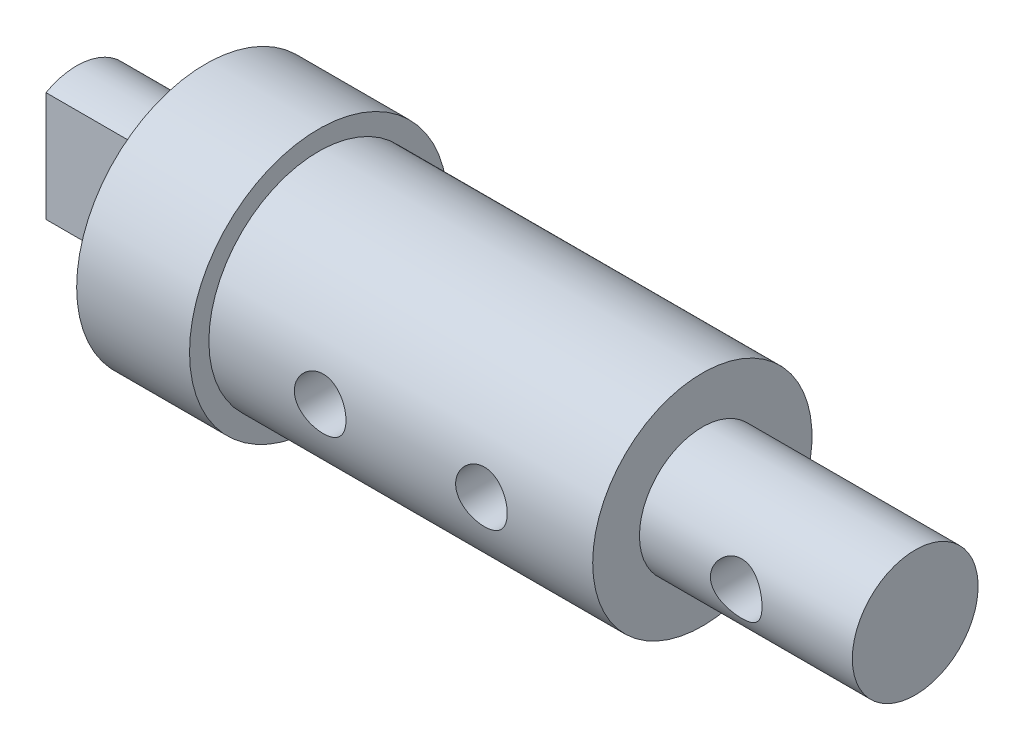
ISO-10303-21;
HEADER;
FILE_DESCRIPTION(('STEP AP214'),'2;1');
FILE_NAME('part.step','',(''),(''),'','','');
FILE_SCHEMA(('AUTOMOTIVE_DESIGN { 1 0 10303 214 1 1 1 1 }'));
ENDSEC;
DATA;
#1=APPLICATION_CONTEXT('core data for automotive mechanical design processes');
#2=APPLICATION_PROTOCOL_DEFINITION('international standard','automotive_design',2000,#1);
#3=PRODUCT_CONTEXT('',#1,'mechanical');
#4=PRODUCT('Part','Part','',(#3));
#5=PRODUCT_RELATED_PRODUCT_CATEGORY('part','',(#4));
#6=PRODUCT_DEFINITION_FORMATION('','',#4);
#7=PRODUCT_DEFINITION_CONTEXT('part definition',#1,'design');
#8=PRODUCT_DEFINITION('design','',#6,#7);
#9=PRODUCT_DEFINITION_SHAPE('','',#8);
#10=(LENGTH_UNIT() NAMED_UNIT(*) SI_UNIT(.MILLI.,.METRE.));
#11=(NAMED_UNIT(*) PLANE_ANGLE_UNIT() SI_UNIT($,.RADIAN.));
#12=(NAMED_UNIT(*) SI_UNIT($,.STERADIAN.) SOLID_ANGLE_UNIT());
#13=UNCERTAINTY_MEASURE_WITH_UNIT(LENGTH_MEASURE(1.E-05),#10,'distance_accuracy_value','');
#14=(GEOMETRIC_REPRESENTATION_CONTEXT(3) GLOBAL_UNCERTAINTY_ASSIGNED_CONTEXT((#13)) GLOBAL_UNIT_ASSIGNED_CONTEXT((#10,
#11,#12)) REPRESENTATION_CONTEXT('',''));
#15=CARTESIAN_POINT('',(0.,0.,0.));
#16=DIRECTION('',(0.,0.,1.));
#17=DIRECTION('',(1.,0.,0.));
#18=AXIS2_PLACEMENT_3D('',#15,#16,#17);
#19=CARTESIAN_POINT('',(-11.,4.,0.));
#20=DIRECTION('',(1.,0.,0.));
#21=DIRECTION('',(0.,0.,-1.));
#22=AXIS2_PLACEMENT_3D('',#19,#20,#21);
#23=PLANE('',#22);
#24=CARTESIAN_POINT('',(-11.,0.,0.));
#25=DIRECTION('',(-1.,0.,0.));
#26=DIRECTION('',(0.,0.,1.));
#27=AXIS2_PLACEMENT_3D('',#24,#25,#26);
#28=CIRCLE('',#27,4.);
#29=CARTESIAN_POINT('',(-11.,0.,4.));
#30=VERTEX_POINT('',#29);
#31=EDGE_CURVE('E103',#30,#30,#28,.T.);
#32=ORIENTED_EDGE('',*,*,#31,.T.);
#33=EDGE_LOOP('',(#32));
#34=FACE_BOUND('',#33,.T.);
#35=CARTESIAN_POINT('',(-11.,0.,0.));
#36=DIRECTION('',(-1.,0.,0.));
#37=DIRECTION('',(0.,0.,1.));
#38=AXIS2_PLACEMENT_3D('',#35,#36,#37);
#39=CIRCLE('',#38,1.95);
#40=CARTESIAN_POINT('',(-11.,1.70293863659264,0.95));
#41=VERTEX_POINT('',#40);
#42=CARTESIAN_POINT('',(-11.,-1.70293863659264,0.95));
#43=VERTEX_POINT('',#42);
#44=EDGE_CURVE('E71',#41,#43,#39,.T.);
#45=ORIENTED_EDGE('',*,*,#44,.F.);
#46=DIRECTION('',(0.,1.,0.));
#47=VECTOR('',#46,1.);
#48=CARTESIAN_POINT('',(-11.,1.70293863659264,0.95));
#49=LINE('',#48,#47);
#50=EDGE_CURVE('E56',#43,#41,#49,.T.);
#51=ORIENTED_EDGE('',*,*,#50,.F.);
#52=EDGE_LOOP('',(#45,#51));
#53=FACE_BOUND('',#52,.T.);
#54=ADVANCED_FACE('F38',(#34,#53),#23,.F.);
#55=CARTESIAN_POINT('',(11.,0.,0.));
#56=DIRECTION('',(-1.,0.,0.));
#57=DIRECTION('',(0.,0.,1.));
#58=AXIS2_PLACEMENT_3D('',#55,#56,#57);
#59=PLANE('',#58);
#60=CARTESIAN_POINT('',(11.,0.,0.));
#61=DIRECTION('',(-1.,0.,0.));
#62=DIRECTION('',(0.,0.,1.));
#63=AXIS2_PLACEMENT_3D('',#60,#61,#62);
#64=CIRCLE('',#63,1.95);
#65=CARTESIAN_POINT('',(11.,0.,1.95));
#66=VERTEX_POINT('',#65);
#67=EDGE_CURVE('E119',#66,#66,#64,.T.);
#68=ORIENTED_EDGE('',*,*,#67,.F.);
#69=EDGE_LOOP('',(#68));
#70=FACE_BOUND('',#69,.T.);
#71=ADVANCED_FACE('F40',(#70),#59,.F.);
#72=CARTESIAN_POINT('',(0.,0.,0.));
#73=DIRECTION('',(-1.,0.,0.));
#74=DIRECTION('',(0.,0.,1.));
#75=AXIS2_PLACEMENT_3D('',#72,#73,#74);
#76=CYLINDRICAL_SURFACE('',#75,1.95);
#77=CARTESIAN_POINT('',(8.2,0.,1.95));
#78=CARTESIAN_POINT('',(8.19999561484422,-0.0429090313419901,1.94999672341557));
#79=CARTESIAN_POINT('',(8.19652724311315,-0.085888342064864,1.94856720628234));
#80=CARTESIAN_POINT('',(8.1827756589033,-0.170631413111786,1.94298745323884));
#81=CARTESIAN_POINT('',(8.17247436845365,-0.212391641271655,1.9388300002972));
#82=CARTESIAN_POINT('',(8.14549892205006,-0.293332706793942,1.92824161861606));
#83=CARTESIAN_POINT('',(8.12884607825116,-0.332521661978991,1.92181829817982));
#84=CARTESIAN_POINT('',(8.08972686451433,-0.407512664985541,1.90732640965225));
#85=CARTESIAN_POINT('',(8.06726235491835,-0.443315791627978,1.89925836821886));
#86=CARTESIAN_POINT('',(8.01599422376931,-0.512328535941208,1.88184548957991));
#87=CARTESIAN_POINT('',(7.98695194370779,-0.545350436491069,1.87245967638695));
#88=CARTESIAN_POINT('',(7.92385691540709,-0.606215314900565,1.85365040280598));
#89=CARTESIAN_POINT('',(7.88980161873364,-0.634055642241007,1.84422692565549));
#90=CARTESIAN_POINT('',(7.81569076461274,-0.685068224505028,1.82591120842074));
#91=CARTESIAN_POINT('',(7.77542742340432,-0.707956963973854,1.81706526245235));
#92=CARTESIAN_POINT('',(7.69120598907634,-0.746553227100349,1.80155327251159));
#93=CARTESIAN_POINT('',(7.64724975476787,-0.762264338268037,1.79488614000379));
#94=CARTESIAN_POINT('',(7.55904984114932,-0.785290354739013,1.7849287525371));
#95=CARTESIAN_POINT('',(7.51491719883067,-0.792965844819978,1.78149424615378));
#96=CARTESIAN_POINT('',(7.42586702385375,-0.800828309110054,1.77797484246209));
#97=CARTESIAN_POINT('',(7.38094991792058,-0.801019235111354,1.77788817751959));
#98=CARTESIAN_POINT('',(7.29514725765571,-0.794179388349747,1.78095178580417));
#99=CARTESIAN_POINT('',(7.25420903844626,-0.78768115995166,1.78386336584154));
#100=CARTESIAN_POINT('',(7.17406547075399,-0.768538670196156,1.79219309966416));
#101=CARTESIAN_POINT('',(7.13486044386342,-0.755893273415524,1.797611716507));
#102=CARTESIAN_POINT('',(7.05832270958237,-0.72457087237544,1.81046615939341));
#103=CARTESIAN_POINT('',(7.02104646164019,-0.70577301351224,1.81794188156145));
#104=CARTESIAN_POINT('',(6.95003550703099,-0.662764489967313,1.83405826915435));
#105=CARTESIAN_POINT('',(6.91630217963794,-0.638551728635918,1.8426993853038));
#106=CARTESIAN_POINT('',(6.85043438462089,-0.583077511996559,1.86103210997552));
#107=CARTESIAN_POINT('',(6.81865565660725,-0.551401819169442,1.87075186794315));
#108=CARTESIAN_POINT('',(6.76074406394002,-0.483071456427335,1.88954932234969));
#109=CARTESIAN_POINT('',(6.7346124428595,-0.446415692718701,1.89862687707092));
#110=CARTESIAN_POINT('',(6.68823676076048,-0.368112749409276,1.91536631307924));
#111=CARTESIAN_POINT('',(6.66813316136798,-0.32637432507312,1.92299309754079));
#112=CARTESIAN_POINT('',(6.63535674002119,-0.239715356645508,1.93570389467281));
#113=CARTESIAN_POINT('',(6.62267994047933,-0.194796530364717,1.94078926823741));
#114=CARTESIAN_POINT('',(6.60585174810321,-0.106028246740718,1.947592446582));
#115=CARTESIAN_POINT('',(6.60122268997408,-0.0622837505311799,1.94949863424514));
#116=CARTESIAN_POINT('',(6.5992026175439,0.025394675090731,1.95032689994955));
#117=CARTESIAN_POINT('',(6.60180960500578,0.0693285488609997,1.94924980182663));
#118=CARTESIAN_POINT('',(6.61384196911744,0.153929784121658,1.94435517646388));
#119=CARTESIAN_POINT('',(6.62293556721853,0.194652915831953,1.94067106370678));
#120=CARTESIAN_POINT('',(6.6472252838577,0.273953719435646,1.93107373958897));
#121=CARTESIAN_POINT('',(6.66242217884788,0.31253111764092,1.92516024461553));
#122=CARTESIAN_POINT('',(6.69898395450667,0.387789767584396,1.9114466003203));
#123=CARTESIAN_POINT('',(6.72052498685184,0.42437553612789,1.90359377896847));
#124=CARTESIAN_POINT('',(6.76896933529564,0.493543234552231,1.88684486743537));
#125=CARTESIAN_POINT('',(6.79587485816018,0.526123507764669,1.87794834853499));
#126=CARTESIAN_POINT('',(6.85646997843418,0.588728992058345,1.85931117667256));
#127=CARTESIAN_POINT('',(6.89050069678151,0.618420212052976,1.84955477593176));
#128=CARTESIAN_POINT('',(6.96322412391789,0.671759343328893,1.83085779829248));
#129=CARTESIAN_POINT('',(7.00191777164973,0.695406034461956,1.82191738634325));
#130=CARTESIAN_POINT('',(7.08358096875058,0.736197343418284,1.80582459713075));
#131=CARTESIAN_POINT('',(7.1265976095117,0.753257657404576,1.79869577814369));
#132=CARTESIAN_POINT('',(7.21527611792536,0.779752559186946,1.78737165979351));
#133=CARTESIAN_POINT('',(7.26093586339064,0.789193176374287,1.78317404135551));
#134=CARTESIAN_POINT('',(7.34991089995457,0.799590354967792,1.77853442087226));
#135=CARTESIAN_POINT('',(7.39314487307093,0.801130612505573,1.77783414009031));
#136=CARTESIAN_POINT('',(7.47922743732201,0.797231752199945,1.77958595754649));
#137=CARTESIAN_POINT('',(7.522076082545,0.79179362980756,1.7820376061687));
#138=CARTESIAN_POINT('',(7.60424385693111,0.774577543050906,1.78958412283097));
#139=CARTESIAN_POINT('',(7.64363538545191,0.763087417138324,1.7945586316436));
#140=CARTESIAN_POINT('',(7.71994330442088,0.734370115122792,1.80649967652534));
#141=CARTESIAN_POINT('',(7.75685900038749,0.717141337322524,1.81346676866137));
#142=CARTESIAN_POINT('',(7.82954532447116,0.676262404791812,1.82911849623992));
#143=CARTESIAN_POINT('',(7.86511955409439,0.652293094373791,1.83788026892508));
#144=CARTESIAN_POINT('',(7.9319238109756,0.599067976193341,1.85591120740309));
#145=CARTESIAN_POINT('',(7.96315240099233,0.569810426761995,1.8651805396563));
#146=CARTESIAN_POINT('',(8.02261565280102,0.504416211253221,1.88395831298191));
#147=CARTESIAN_POINT('',(8.05049002288026,0.467942243301299,1.89343840250229));
#148=CARTESIAN_POINT('',(8.09973660829594,0.390479589657616,1.91091593888135));
#149=CARTESIAN_POINT('',(8.12110584241506,0.349488845672379,1.91891270529891));
#150=CARTESIAN_POINT('',(8.15625657521897,0.264840783941895,1.93239871367988));
#151=CARTESIAN_POINT('',(8.17016377058915,0.221242358589278,1.93792921101508));
#152=CARTESIAN_POINT('',(8.19032546727703,0.132131952930182,1.94602839446739));
#153=CARTESIAN_POINT('',(8.19660405760962,0.0866264679456242,1.94860640223781));
#154=CARTESIAN_POINT('',(8.19965144107654,0.027324271815631,1.94985742350373));
#155=CARTESIAN_POINT('',(8.20000139658767,0.0136657001260131,1.95000104352904));
#156=CARTESIAN_POINT('',(8.2,0.,1.95));
#157=B_SPLINE_CURVE_WITH_KNOTS('',3,(#77,#78,#79,#80,#81,#82,#83,#84,#85,#86,#87,#88,#89,#90,
#91,#92,#93,#94,#95,#96,#97,#98,#99,#100,#101,#102,#103,#104,#105,#106,#107,#108,#109,#110,#111,
#112,#113,#114,#115,#116,#117,#118,#119,#120,#121,#122,#123,#124,#125,#126,#127,#128,#129,#130,
#131,#132,#133,#134,#135,#136,#137,#138,#139,#140,#141,#142,#143,#144,#145,#146,#147,#148,#149,
#150,#151,#152,#153,#154,#155,#156),.UNSPECIFIED.,.T.,.F.,(4,2,2,2,2,2,2,2,2,2,2,2,2,2,2,2,2,2,
2,2,2,2,2,2,2,2,2,2,2,2,2,2,2,2,2,2,2,2,2,4),(0.,0.12868910604015,0.257720052398303,
0.386321800791211,0.514882433978023,0.649195259547643,0.783576602170147,0.924322071105401,
1.06499711570778,1.19904683011433,1.33302576635029,1.45710545627069,1.58120807325486,
1.70791159927516,1.83466427008986,1.97177168074285,2.10890925369481,2.24903045333578,
2.38907653919041,2.52048365488044,2.6518544860504,2.77694759457687,2.90205662230101,
3.03103321944288,3.16006298297189,3.29804287985753,3.43605060740075,3.57577045259725,
3.71537963016197,3.8445083327689,3.97361861748907,4.09707916302988,4.22057419617525,
4.35136297502192,4.48219490759108,4.62214410942357,4.76215735189233,4.89973150301332,
5.03687009464332,5.07785509657946),.UNSPECIFIED.);
#158=CARTESIAN_POINT('',(8.2,0.,1.95));
#159=VERTEX_POINT('',#158);
#160=EDGE_CURVE('E42',#159,#159,#157,.T.);
#161=ORIENTED_EDGE('',*,*,#160,.T.);
#162=EDGE_LOOP('',(#161));
#163=FACE_BOUND('',#162,.T.);
#164=CARTESIAN_POINT('',(4.4,0.,0.));
#165=DIRECTION('',(-1.,0.,0.));
#166=DIRECTION('',(0.,0.,1.));
#167=AXIS2_PLACEMENT_3D('',#164,#165,#166);
#168=CIRCLE('',#167,1.95);
#169=CARTESIAN_POINT('',(4.4,0.,1.95));
#170=VERTEX_POINT('',#169);
#171=EDGE_CURVE('E116',#170,#170,#168,.T.);
#172=ORIENTED_EDGE('',*,*,#171,.F.);
#173=EDGE_LOOP('',(#172));
#174=FACE_BOUND('',#173,.T.);
#175=ORIENTED_EDGE('',*,*,#67,.T.);
#176=EDGE_LOOP('',(#175));
#177=FACE_BOUND('',#176,.T.);
#178=ADVANCED_FACE('F168',(#163,#174,#177),#76,.T.);
#179=CARTESIAN_POINT('',(4.4,1.95,0.));
#180=DIRECTION('',(-1.,0.,0.));
#181=DIRECTION('',(0.,0.,1.));
#182=AXIS2_PLACEMENT_3D('',#179,#180,#181);
#183=PLANE('',#182);
#184=CARTESIAN_POINT('',(4.4,0.,0.));
#185=DIRECTION('',(-1.,0.,0.));
#186=DIRECTION('',(0.,0.,1.));
#187=AXIS2_PLACEMENT_3D('',#184,#185,#186);
#188=CIRCLE('',#187,3.4);
#189=CARTESIAN_POINT('',(4.4,0.,3.4));
#190=VERTEX_POINT('',#189);
#191=EDGE_CURVE('E113',#190,#190,#188,.T.);
#192=ORIENTED_EDGE('',*,*,#191,.F.);
#193=EDGE_LOOP('',(#192));
#194=FACE_BOUND('',#193,.T.);
#195=ORIENTED_EDGE('',*,*,#171,.T.);
#196=EDGE_LOOP('',(#195));
#197=FACE_BOUND('',#196,.T.);
#198=ADVANCED_FACE('F157',(#194,#197),#183,.F.);
#199=CARTESIAN_POINT('',(0.,0.,0.));
#200=DIRECTION('',(-1.,0.,0.));
#201=DIRECTION('',(0.,0.,1.));
#202=AXIS2_PLACEMENT_3D('',#199,#200,#201);
#203=CYLINDRICAL_SURFACE('',#202,3.4);
#204=CARTESIAN_POINT('',(-3.25000000000001,0.,3.4));
#205=CARTESIAN_POINT('',(-3.25000138257624,-0.0442828890104494,3.39999920700193));
#206=CARTESIAN_POINT('',(-3.25368922104659,-0.0885818084291685,3.39912616024286));
#207=CARTESIAN_POINT('',(-3.26832435041599,-0.175915514940349,3.39572786107722));
#208=CARTESIAN_POINT('',(-3.27927627604453,-0.218949476629174,3.39320155384915));
#209=CARTESIAN_POINT('',(-3.30807295814917,-0.302479006926497,3.38677723200764));
#210=CARTESIAN_POINT('',(-3.32590995546436,-0.342977373538071,3.38288076194345));
#211=CARTESIAN_POINT('',(-3.36794442721601,-0.420406214773078,3.37413377831048));
#212=CARTESIAN_POINT('',(-3.39214193510014,-0.45733667063274,3.36928325972473));
#213=CARTESIAN_POINT('',(-3.44668124609245,-0.527261498610895,3.35905731087336));
#214=CARTESIAN_POINT('',(-3.47711786750283,-0.560180846727603,3.35367453839874));
#215=CARTESIAN_POINT('',(-3.54306814651544,-0.620497668251346,3.34304094348988));
#216=CARTESIAN_POINT('',(-3.57858231552232,-0.647894584774907,3.33779013440955));
#217=CARTESIAN_POINT('',(-3.65424858455981,-0.69673104212994,3.3279417895732));
#218=CARTESIAN_POINT('',(-3.69445490660497,-0.718088631208784,3.32335361904944));
#219=CARTESIAN_POINT('',(-3.77801217586982,-0.753713813969134,3.3154563319138));
#220=CARTESIAN_POINT('',(-3.82136268180773,-0.76798240038408,3.31214703622461));
#221=CARTESIAN_POINT('',(-3.90915804781412,-0.788772472038238,3.30725733754028));
#222=CARTESIAN_POINT('',(-3.95356949759591,-0.79542787094868,3.30564708945677));
#223=CARTESIAN_POINT('',(-4.04290551852117,-0.801219421936976,3.3042483281059));
#224=CARTESIAN_POINT('',(-4.08783001530427,-0.800356650215363,3.30445955410068));
#225=CARTESIAN_POINT('',(-4.17590573272851,-0.791243640668968,3.30665295276135));
#226=CARTESIAN_POINT('',(-4.21907434515511,-0.783150998476764,3.3085973441129));
#227=CARTESIAN_POINT('',(-4.30342340451584,-0.760058530904059,3.31397801235517));
#228=CARTESIAN_POINT('',(-4.34460372414559,-0.745058263895399,3.31741438463254));
#229=CARTESIAN_POINT('',(-4.42423972600033,-0.708437040815857,3.32542773258422));
#230=CARTESIAN_POINT('',(-4.46266729571102,-0.686757246492453,3.33001477467667));
#231=CARTESIAN_POINT('',(-4.53539646765892,-0.637433629899277,3.33980670142656));
#232=CARTESIAN_POINT('',(-4.56969742336945,-0.609788874974957,3.34501168264489));
#233=CARTESIAN_POINT('',(-4.63410491629845,-0.548495026538218,3.35561357855381));
#234=CARTESIAN_POINT('',(-4.6640842982305,-0.514712433585336,3.36101202846297));
#235=CARTESIAN_POINT('',(-4.71797472638752,-0.442536048991823,3.37127401291468));
#236=CARTESIAN_POINT('',(-4.74188562650652,-0.404142146361179,3.3761375345766));
#237=CARTESIAN_POINT('',(-4.78299952809346,-0.323664358942364,3.38480157856909));
#238=CARTESIAN_POINT('',(-4.80018382131188,-0.281570576015671,3.38859912801242));
#239=CARTESIAN_POINT('',(-4.8271984549588,-0.194983075119437,3.39468153983429));
#240=CARTESIAN_POINT('',(-4.83703003729851,-0.150489763804476,3.39696665766292));
#241=CARTESIAN_POINT('',(-4.84887048102671,-0.061455065428755,3.39972963105663));
#242=CARTESIAN_POINT('',(-4.8510527545065,-0.0169379503659723,3.40024754238881));
#243=CARTESIAN_POINT('',(-4.84800553527808,0.071824979053773,3.39953094033689));
#244=CARTESIAN_POINT('',(-4.84277662908591,0.116070814601321,3.39829656562758));
#245=CARTESIAN_POINT('',(-4.82519888530828,0.202446218909627,3.3942395713106));
#246=CARTESIAN_POINT('',(-4.81294288220855,0.244595740300946,3.39143767165295));
#247=CARTESIAN_POINT('',(-4.78176342607093,0.326239658114239,3.38456018464209));
#248=CARTESIAN_POINT('',(-4.76283934740314,0.365733804982417,3.38048447777842));
#249=CARTESIAN_POINT('',(-4.71851266362885,0.441649076939153,3.37141401862615));
#250=CARTESIAN_POINT('',(-4.69301061967595,0.478010459574205,3.3664055208171));
#251=CARTESIAN_POINT('',(-4.63638084678495,0.545999609890309,3.35604963921623));
#252=CARTESIAN_POINT('',(-4.60525226397797,0.577626657767403,3.35070220406827));
#253=CARTESIAN_POINT('',(-4.537452093631,0.635950086248905,3.34012972984141));
#254=CARTESIAN_POINT('',(-4.50067551399393,0.662525528481494,3.3349098114692));
#255=CARTESIAN_POINT('',(-4.42308059491178,0.709125255454785,3.32531346767939));
#256=CARTESIAN_POINT('',(-4.38226243620765,0.729149832980448,3.32093700456791));
#257=CARTESIAN_POINT('',(-4.29796594709772,0.761935376062775,3.31356862031388));
#258=CARTESIAN_POINT('',(-4.25450491897498,0.774738916381593,3.3105686037199));
#259=CARTESIAN_POINT('',(-4.16596718678061,0.792838076864988,3.30628127954266));
#260=CARTESIAN_POINT('',(-4.12089079048705,0.798135119535665,3.30499364745974));
#261=CARTESIAN_POINT('',(-4.03162681292975,0.801003146635239,3.30429956964793));
#262=CARTESIAN_POINT('',(-3.98744567569744,0.798766627413206,3.30484625240445));
#263=CARTESIAN_POINT('',(-3.90010918556686,0.787066611938105,3.30765198526178));
#264=CARTESIAN_POINT('',(-3.85695381642731,0.777603230188658,3.30991100823198));
#265=CARTESIAN_POINT('',(-3.77307579097342,0.751817531882083,3.31586231665974));
#266=CARTESIAN_POINT('',(-3.73234272982121,0.73552740242264,3.31954787008928));
#267=CARTESIAN_POINT('',(-3.65416071465468,0.696576876392527,3.32793867266915));
#268=CARTESIAN_POINT('',(-3.61671216355573,0.673915699706666,3.3326440466772));
#269=CARTESIAN_POINT('',(-3.54522277656047,0.622245929440386,3.34268106211181));
#270=CARTESIAN_POINT('',(-3.51128143846707,0.593101982352834,3.34802472269653));
#271=CARTESIAN_POINT('',(-3.44870825839007,0.529562931526203,3.35866026246648));
#272=CARTESIAN_POINT('',(-3.42007765966705,0.495166601615449,3.36395212925266));
#273=CARTESIAN_POINT('',(-3.36850842708034,0.421454383265142,3.37398570433263));
#274=CARTESIAN_POINT('',(-3.34566514199259,0.382070362079803,3.37871758722063));
#275=CARTESIAN_POINT('',(-3.30695966133519,0.299915740605452,3.38699708058372));
#276=CARTESIAN_POINT('',(-3.29109204293149,0.257147801580798,3.39054561046907));
#277=CARTESIAN_POINT('',(-3.26937585077079,0.178662632892243,3.39548062309097));
#278=CARTESIAN_POINT('',(-3.2621246931537,0.143345464630853,3.39716431439956));
#279=CARTESIAN_POINT('',(-3.25243634711825,0.0720223718642146,3.39942429276551));
#280=CARTESIAN_POINT('',(-3.24999887551285,0.0360164880016412,3.40000064496708));
#281=CARTESIAN_POINT('',(-3.25000000000001,0.,3.4));
#282=B_SPLINE_CURVE_WITH_KNOTS('',3,(#204,#205,#206,#207,#208,#209,#210,#211,#212,#213,#214,
#215,#216,#217,#218,#219,#220,#221,#222,#223,#224,#225,#226,#227,#228,#229,#230,#231,#232,#233,
#234,#235,#236,#237,#238,#239,#240,#241,#242,#243,#244,#245,#246,#247,#248,#249,#250,#251,#252,
#253,#254,#255,#256,#257,#258,#259,#260,#261,#262,#263,#264,#265,#266,#267,#268,#269,#270,#271,
#272,#273,#274,#275,#276,#277,#278,#279,#280,#281),.UNSPECIFIED.,.T.,.F.,(4,2,2,2,2,2,2,2,2,2,2,
2,2,2,2,2,2,2,2,2,2,2,2,2,2,2,2,2,2,2,2,2,2,2,2,2,2,2,4),(0.,0.132716755427583,
0.265518270125257,0.398170558489669,0.530823544439286,0.665665930059246,0.800521906426332,
0.937128498860594,1.07371595571388,1.2078620387184,1.34198891948327,1.47326158640889,
1.60454264721202,1.73701489454393,1.8695078696723,2.00533236125466,2.1411601226639,
2.27736301305952,2.41354289287804,2.54661482614613,2.679676228774,2.81101898923861,
2.94237407617554,3.07584487259291,3.20933594122299,3.34570363234417,3.48206522780202,
3.61761420637393,3.75313749453009,3.88522445370752,4.01730932012046,4.14877831060256,
4.28026340607571,4.41480617201549,4.54938039519267,4.6860455254347,4.82260422448084,
4.93055275191511,5.03849492859528),.UNSPECIFIED.);
#283=CARTESIAN_POINT('',(-3.25000000000001,0.,3.4));
#284=VERTEX_POINT('',#283);
#285=EDGE_CURVE('E11',#284,#284,#282,.T.);
#286=ORIENTED_EDGE('',*,*,#285,.T.);
#287=EDGE_LOOP('',(#286));
#288=FACE_BOUND('',#287,.T.);
#289=CARTESIAN_POINT('',(-3.25000000000001,0.,-3.4));
#290=CARTESIAN_POINT('',(-3.25000138257624,0.0442828890104494,-3.39999920700193));
#291=CARTESIAN_POINT('',(-3.25368922104659,0.0885818084291685,-3.39912616024286));
#292=CARTESIAN_POINT('',(-3.26832435041599,0.175915514940349,-3.39572786107722));
#293=CARTESIAN_POINT('',(-3.27927627604453,0.218949476629174,-3.39320155384915));
#294=CARTESIAN_POINT('',(-3.30807295814917,0.302479006926497,-3.38677723200764));
#295=CARTESIAN_POINT('',(-3.32590995546436,0.342977373538071,-3.38288076194345));
#296=CARTESIAN_POINT('',(-3.36794442721601,0.420406214773078,-3.37413377831048));
#297=CARTESIAN_POINT('',(-3.39214193510014,0.45733667063274,-3.36928325972473));
#298=CARTESIAN_POINT('',(-3.44668124609245,0.527261498610895,-3.35905731087336));
#299=CARTESIAN_POINT('',(-3.47711786750283,0.560180846727603,-3.35367453839874));
#300=CARTESIAN_POINT('',(-3.54306814651544,0.620497668251346,-3.34304094348988));
#301=CARTESIAN_POINT('',(-3.57858231552232,0.647894584774908,-3.33779013440955));
#302=CARTESIAN_POINT('',(-3.65424858455981,0.69673104212994,-3.3279417895732));
#303=CARTESIAN_POINT('',(-3.69445490660497,0.718088631208784,-3.32335361904944));
#304=CARTESIAN_POINT('',(-3.77801217586982,0.753713813969134,-3.3154563319138));
#305=CARTESIAN_POINT('',(-3.82136268180773,0.76798240038408,-3.31214703622461));
#306=CARTESIAN_POINT('',(-3.90915804781412,0.788772472038238,-3.30725733754028));
#307=CARTESIAN_POINT('',(-3.95356949759591,0.79542787094868,-3.30564708945677));
#308=CARTESIAN_POINT('',(-4.04290551852117,0.801219421936976,-3.3042483281059));
#309=CARTESIAN_POINT('',(-4.08783001530427,0.800356650215363,-3.30445955410068));
#310=CARTESIAN_POINT('',(-4.17590573272851,0.791243640668968,-3.30665295276135));
#311=CARTESIAN_POINT('',(-4.21907434515511,0.783150998476764,-3.3085973441129));
#312=CARTESIAN_POINT('',(-4.30342340451584,0.760058530904059,-3.31397801235517));
#313=CARTESIAN_POINT('',(-4.34460372414559,0.745058263895399,-3.31741438463254));
#314=CARTESIAN_POINT('',(-4.42423972600033,0.708437040815857,-3.32542773258422));
#315=CARTESIAN_POINT('',(-4.46266729571102,0.686757246492453,-3.33001477467667));
#316=CARTESIAN_POINT('',(-4.53539646765892,0.637433629899277,-3.33980670142656));
#317=CARTESIAN_POINT('',(-4.56969742336945,0.609788874974957,-3.34501168264489));
#318=CARTESIAN_POINT('',(-4.63410491629845,0.548495026538218,-3.35561357855381));
#319=CARTESIAN_POINT('',(-4.6640842982305,0.514712433585336,-3.36101202846297));
#320=CARTESIAN_POINT('',(-4.71797472638752,0.442536048991823,-3.37127401291468));
#321=CARTESIAN_POINT('',(-4.74188562650652,0.404142146361179,-3.3761375345766));
#322=CARTESIAN_POINT('',(-4.78299952809346,0.323664358942364,-3.38480157856909));
#323=CARTESIAN_POINT('',(-4.80018382131188,0.281570576015671,-3.38859912801242));
#324=CARTESIAN_POINT('',(-4.8271984549588,0.194983075119437,-3.39468153983429));
#325=CARTESIAN_POINT('',(-4.83703003729851,0.150489763804476,-3.39696665766292));
#326=CARTESIAN_POINT('',(-4.84887048102671,0.0614550654287549,-3.39972963105663));
#327=CARTESIAN_POINT('',(-4.8510527545065,0.016937950365972,-3.40024754238881));
#328=CARTESIAN_POINT('',(-4.84800553527808,-0.0718249790537733,-3.39953094033689));
#329=CARTESIAN_POINT('',(-4.84277662908591,-0.116070814601321,-3.39829656562758));
#330=CARTESIAN_POINT('',(-4.82519888530828,-0.202446218909627,-3.3942395713106));
#331=CARTESIAN_POINT('',(-4.81294288220854,-0.244595740300947,-3.39143767165295));
#332=CARTESIAN_POINT('',(-4.78176342607093,-0.32623965811424,-3.38456018464209));
#333=CARTESIAN_POINT('',(-4.76283934740314,-0.365733804982417,-3.38048447777842));
#334=CARTESIAN_POINT('',(-4.71851266362885,-0.441649076939153,-3.37141401862615));
#335=CARTESIAN_POINT('',(-4.69301061967595,-0.478010459574205,-3.3664055208171));
#336=CARTESIAN_POINT('',(-4.63638084678495,-0.545999609890309,-3.35604963921623));
#337=CARTESIAN_POINT('',(-4.60525226397797,-0.577626657767403,-3.35070220406827));
#338=CARTESIAN_POINT('',(-4.537452093631,-0.635950086248905,-3.34012972984141));
#339=CARTESIAN_POINT('',(-4.50067551399393,-0.662525528481494,-3.3349098114692));
#340=CARTESIAN_POINT('',(-4.42308059491178,-0.709125255454785,-3.32531346767939));
#341=CARTESIAN_POINT('',(-4.38226243620765,-0.729149832980448,-3.32093700456791));
#342=CARTESIAN_POINT('',(-4.29796594709772,-0.761935376062775,-3.31356862031388));
#343=CARTESIAN_POINT('',(-4.25450491897498,-0.774738916381593,-3.3105686037199));
#344=CARTESIAN_POINT('',(-4.16596718678061,-0.792838076864988,-3.30628127954266));
#345=CARTESIAN_POINT('',(-4.12089079048705,-0.798135119535665,-3.30499364745974));
#346=CARTESIAN_POINT('',(-4.03162681292975,-0.801003146635239,-3.30429956964793));
#347=CARTESIAN_POINT('',(-3.98744567569744,-0.798766627413206,-3.30484625240445));
#348=CARTESIAN_POINT('',(-3.90010918556686,-0.787066611938105,-3.30765198526178));
#349=CARTESIAN_POINT('',(-3.85695381642731,-0.777603230188658,-3.30991100823198));
#350=CARTESIAN_POINT('',(-3.77307579097342,-0.751817531882083,-3.31586231665974));
#351=CARTESIAN_POINT('',(-3.73234272982121,-0.73552740242264,-3.31954787008928));
#352=CARTESIAN_POINT('',(-3.65416071465468,-0.696576876392527,-3.32793867266915));
#353=CARTESIAN_POINT('',(-3.61671216355573,-0.673915699706666,-3.3326440466772));
#354=CARTESIAN_POINT('',(-3.54522277656047,-0.622245929440386,-3.34268106211181));
#355=CARTESIAN_POINT('',(-3.51128143846707,-0.593101982352834,-3.34802472269653));
#356=CARTESIAN_POINT('',(-3.44870825839007,-0.529562931526203,-3.35866026246648));
#357=CARTESIAN_POINT('',(-3.42007765966705,-0.495166601615449,-3.36395212925266));
#358=CARTESIAN_POINT('',(-3.36850842708034,-0.421454383265142,-3.37398570433263));
#359=CARTESIAN_POINT('',(-3.34566514199259,-0.382070362079803,-3.37871758722063));
#360=CARTESIAN_POINT('',(-3.30695966133519,-0.299915740605452,-3.38699708058372));
#361=CARTESIAN_POINT('',(-3.29109204293149,-0.257147801580798,-3.39054561046907));
#362=CARTESIAN_POINT('',(-3.26937585077079,-0.178662632892243,-3.39548062309097));
#363=CARTESIAN_POINT('',(-3.2621246931537,-0.143345464630853,-3.39716431439956));
#364=CARTESIAN_POINT('',(-3.25243634711825,-0.0720223718642146,-3.39942429276551));
#365=CARTESIAN_POINT('',(-3.24999887551285,-0.0360164880016412,-3.40000064496708));
#366=CARTESIAN_POINT('',(-3.25000000000001,0.,-3.4));
#367=B_SPLINE_CURVE_WITH_KNOTS('',3,(#289,#290,#291,#292,#293,#294,#295,#296,#297,#298,#299,
#300,#301,#302,#303,#304,#305,#306,#307,#308,#309,#310,#311,#312,#313,#314,#315,#316,#317,#318,
#319,#320,#321,#322,#323,#324,#325,#326,#327,#328,#329,#330,#331,#332,#333,#334,#335,#336,#337,
#338,#339,#340,#341,#342,#343,#344,#345,#346,#347,#348,#349,#350,#351,#352,#353,#354,#355,#356,
#357,#358,#359,#360,#361,#362,#363,#364,#365,#366),.UNSPECIFIED.,.T.,.F.,(4,2,2,2,2,2,2,2,2,2,2,
2,2,2,2,2,2,2,2,2,2,2,2,2,2,2,2,2,2,2,2,2,2,2,2,2,2,2,4),(0.,0.132716755427583,
0.265518270125257,0.398170558489669,0.530823544439286,0.665665930059246,0.800521906426332,
0.937128498860594,1.07371595571388,1.2078620387184,1.34198891948327,1.47326158640889,
1.60454264721202,1.73701489454393,1.8695078696723,2.00533236125466,2.1411601226639,
2.27736301305952,2.41354289287804,2.54661482614613,2.679676228774,2.81101898923861,
2.94237407617554,3.0758448725929,3.20933594122299,3.34570363234417,3.48206522780202,
3.61761420637393,3.75313749453008,3.88522445370752,4.01730932012046,4.14877831060256,
4.28026340607571,4.41480617201548,4.54938039519267,4.6860455254347,4.82260422448084,
4.93055275191511,5.03849492859528),.UNSPECIFIED.);
#368=CARTESIAN_POINT('',(-3.25000000000001,0.,-3.4));
#369=VERTEX_POINT('',#368);
#370=EDGE_CURVE('E102',#369,#369,#367,.T.);
#371=ORIENTED_EDGE('',*,*,#370,.T.);
#372=EDGE_LOOP('',(#371));
#373=FACE_BOUND('',#372,.T.);
#374=CARTESIAN_POINT('',(1.74999999999999,0.,3.4));
#375=CARTESIAN_POINT('',(1.74999861742376,-0.0442828890104494,3.39999920700193));
#376=CARTESIAN_POINT('',(1.74631077895341,-0.0885818084291685,3.39912616024286));
#377=CARTESIAN_POINT('',(1.73167564958401,-0.175915514940349,3.39572786107722));
#378=CARTESIAN_POINT('',(1.72072372395547,-0.218949476629174,3.39320155384915));
#379=CARTESIAN_POINT('',(1.69192704185083,-0.302479006926497,3.38677723200764));
#380=CARTESIAN_POINT('',(1.67409004453564,-0.342977373538071,3.38288076194345));
#381=CARTESIAN_POINT('',(1.63205557278399,-0.420406214773078,3.37413377831048));
#382=CARTESIAN_POINT('',(1.60785806489986,-0.45733667063274,3.36928325972473));
#383=CARTESIAN_POINT('',(1.55331875390755,-0.527261498610895,3.35905731087336));
#384=CARTESIAN_POINT('',(1.52288213249717,-0.560180846727602,3.35367453839874));
#385=CARTESIAN_POINT('',(1.45693185348456,-0.620497668251346,3.34304094348988));
#386=CARTESIAN_POINT('',(1.42141768447768,-0.647894584774907,3.33779013440955));
#387=CARTESIAN_POINT('',(1.34575141544019,-0.69673104212994,3.3279417895732));
#388=CARTESIAN_POINT('',(1.30554509339503,-0.718088631208784,3.32335361904944));
#389=CARTESIAN_POINT('',(1.22198782413018,-0.753713813969134,3.3154563319138));
#390=CARTESIAN_POINT('',(1.17863731819227,-0.76798240038408,3.31214703622461));
#391=CARTESIAN_POINT('',(1.09084195218588,-0.788772472038238,3.30725733754028));
#392=CARTESIAN_POINT('',(1.04643050240409,-0.79542787094868,3.30564708945677));
#393=CARTESIAN_POINT('',(0.957094481478833,-0.801219421936976,3.3042483281059));
#394=CARTESIAN_POINT('',(0.912169984695734,-0.800356650215363,3.30445955410068));
#395=CARTESIAN_POINT('',(0.824094267271491,-0.791243640668968,3.30665295276135));
#396=CARTESIAN_POINT('',(0.780925654844895,-0.783150998476764,3.3085973441129));
#397=CARTESIAN_POINT('',(0.696576595484161,-0.760058530904059,3.31397801235517));
#398=CARTESIAN_POINT('',(0.655396275854416,-0.745058263895399,3.31741438463254));
#399=CARTESIAN_POINT('',(0.575760273999668,-0.708437040815857,3.32542773258422));
#400=CARTESIAN_POINT('',(0.537332704288984,-0.686757246492453,3.33001477467667));
#401=CARTESIAN_POINT('',(0.464603532341077,-0.637433629899277,3.33980670142656));
#402=CARTESIAN_POINT('',(0.43030257663055,-0.609788874974957,3.34501168264489));
#403=CARTESIAN_POINT('',(0.36589508370155,-0.548495026538217,3.35561357855381));
#404=CARTESIAN_POINT('',(0.335915701769497,-0.514712433585335,3.36101202846297));
#405=CARTESIAN_POINT('',(0.282025273612485,-0.442536048991823,3.37127401291468));
#406=CARTESIAN_POINT('',(0.258114373493481,-0.404142146361178,3.3761375345766));
#407=CARTESIAN_POINT('',(0.217000471906538,-0.323664358942363,3.38480157856909));
#408=CARTESIAN_POINT('',(0.199816178688124,-0.28157057601567,3.38859912801242));
#409=CARTESIAN_POINT('',(0.172801545041196,-0.194983075119436,3.39468153983429));
#410=CARTESIAN_POINT('',(0.162969962701489,-0.150489763804476,3.39696665766292));
#411=CARTESIAN_POINT('',(0.151129518973295,-0.061455065428755,3.39972963105663));
#412=CARTESIAN_POINT('',(0.148947245493496,-0.0169379503659722,3.40024754238881));
#413=CARTESIAN_POINT('',(0.151994464721916,0.0718249790537733,3.39953094033689));
#414=CARTESIAN_POINT('',(0.157223370914088,0.116070814601321,3.39829656562758));
#415=CARTESIAN_POINT('',(0.17480111469172,0.202446218909628,3.3942395713106));
#416=CARTESIAN_POINT('',(0.187057117791456,0.244595740300947,3.39143767165295));
#417=CARTESIAN_POINT('',(0.218236573929074,0.32623965811424,3.38456018464209));
#418=CARTESIAN_POINT('',(0.237160652596862,0.365733804982417,3.38048447777842));
#419=CARTESIAN_POINT('',(0.281487336371151,0.441649076939154,3.37141401862615));
#420=CARTESIAN_POINT('',(0.306989380324053,0.478010459574206,3.3664055208171));
#421=CARTESIAN_POINT('',(0.36361915321505,0.54599960989031,3.35604963921623));
#422=CARTESIAN_POINT('',(0.394747736022033,0.577626657767403,3.35070220406827));
#423=CARTESIAN_POINT('',(0.462547906369004,0.635950086248905,3.34012972984141));
#424=CARTESIAN_POINT('',(0.499324486006067,0.662525528481494,3.3349098114692));
#425=CARTESIAN_POINT('',(0.576919405088224,0.709125255454785,3.32531346767939));
#426=CARTESIAN_POINT('',(0.617737563792355,0.729149832980448,3.32093700456791));
#427=CARTESIAN_POINT('',(0.702034052902278,0.761935376062775,3.31356862031388));
#428=CARTESIAN_POINT('',(0.745495081025026,0.774738916381593,3.3105686037199));
#429=CARTESIAN_POINT('',(0.834032813219392,0.792838076864988,3.30628127954267));
#430=CARTESIAN_POINT('',(0.87910920951295,0.798135119535665,3.30499364745974));
#431=CARTESIAN_POINT('',(0.968373187070251,0.801003146635239,3.30429956964793));
#432=CARTESIAN_POINT('',(1.01255432430256,0.798766627413206,3.30484625240445));
#433=CARTESIAN_POINT('',(1.09989081443314,0.787066611938104,3.30765198526178));
#434=CARTESIAN_POINT('',(1.14304618357269,0.777603230188658,3.30991100823198));
#435=CARTESIAN_POINT('',(1.22692420902658,0.751817531882082,3.31586231665974));
#436=CARTESIAN_POINT('',(1.2676572701788,0.73552740242264,3.31954787008928));
#437=CARTESIAN_POINT('',(1.34583928534532,0.696576876392526,3.32793867266915));
#438=CARTESIAN_POINT('',(1.38328783644427,0.673915699706666,3.3326440466772));
#439=CARTESIAN_POINT('',(1.45477722343954,0.622245929440385,3.34268106211181));
#440=CARTESIAN_POINT('',(1.48871856153293,0.593101982352834,3.34802472269653));
#441=CARTESIAN_POINT('',(1.55129174160993,0.529562931526203,3.35866026246648));
#442=CARTESIAN_POINT('',(1.57992234033295,0.495166601615449,3.36395212925266));
#443=CARTESIAN_POINT('',(1.63149157291966,0.421454383265141,3.37398570433263));
#444=CARTESIAN_POINT('',(1.65433485800741,0.382070362079803,3.37871758722063));
#445=CARTESIAN_POINT('',(1.69304033866481,0.299915740605451,3.38699708058372));
#446=CARTESIAN_POINT('',(1.70890795706851,0.257147801580797,3.39054561046907));
#447=CARTESIAN_POINT('',(1.73062414922921,0.178662632892242,3.39548062309097));
#448=CARTESIAN_POINT('',(1.7378753068463,0.143345464630852,3.39716431439956));
#449=CARTESIAN_POINT('',(1.74756365288175,0.0720223718642141,3.39942429276551));
#450=CARTESIAN_POINT('',(1.75000112448716,0.036016488001641,3.40000064496708));
#451=CARTESIAN_POINT('',(1.74999999999999,0.,3.4));
#452=B_SPLINE_CURVE_WITH_KNOTS('',3,(#374,#375,#376,#377,#378,#379,#380,#381,#382,#383,#384,
#385,#386,#387,#388,#389,#390,#391,#392,#393,#394,#395,#396,#397,#398,#399,#400,#401,#402,#403,
#404,#405,#406,#407,#408,#409,#410,#411,#412,#413,#414,#415,#416,#417,#418,#419,#420,#421,#422,
#423,#424,#425,#426,#427,#428,#429,#430,#431,#432,#433,#434,#435,#436,#437,#438,#439,#440,#441,
#442,#443,#444,#445,#446,#447,#448,#449,#450,#451),.UNSPECIFIED.,.T.,.F.,(4,2,2,2,2,2,2,2,2,2,2,
2,2,2,2,2,2,2,2,2,2,2,2,2,2,2,2,2,2,2,2,2,2,2,2,2,2,2,4),(0.,0.132716755427583,
0.265518270125257,0.398170558489669,0.530823544439286,0.665665930059245,0.800521906426332,
0.937128498860594,1.07371595571388,1.2078620387184,1.34198891948327,1.47326158640889,
1.60454264721202,1.73701489454393,1.8695078696723,2.00533236125466,2.1411601226639,
2.27736301305952,2.41354289287804,2.54661482614613,2.679676228774,2.81101898923861,
2.94237407617553,3.07584487259291,3.20933594122299,3.34570363234417,3.48206522780202,
3.61761420637393,3.75313749453008,3.88522445370752,4.01730932012046,4.14877831060256,
4.28026340607571,4.41480617201548,4.54938039519267,4.6860455254347,4.82260422448084,
4.93055275191511,5.03849492859528),.UNSPECIFIED.);
#453=CARTESIAN_POINT('',(1.74999999999999,0.,3.4));
#454=VERTEX_POINT('',#453);
#455=EDGE_CURVE('E50',#454,#454,#452,.T.);
#456=ORIENTED_EDGE('',*,*,#455,.T.);
#457=EDGE_LOOP('',(#456));
#458=FACE_BOUND('',#457,.T.);
#459=CARTESIAN_POINT('',(1.74999999999999,0.,-3.4));
#460=CARTESIAN_POINT('',(1.74999861742376,0.0442828890104494,-3.39999920700193));
#461=CARTESIAN_POINT('',(1.74631077895341,0.0885818084291685,-3.39912616024286));
#462=CARTESIAN_POINT('',(1.73167564958401,0.175915514940349,-3.39572786107722));
#463=CARTESIAN_POINT('',(1.72072372395547,0.218949476629174,-3.39320155384915));
#464=CARTESIAN_POINT('',(1.69192704185083,0.302479006926497,-3.38677723200764));
#465=CARTESIAN_POINT('',(1.67409004453564,0.342977373538071,-3.38288076194345));
#466=CARTESIAN_POINT('',(1.63205557278399,0.420406214773078,-3.37413377831048));
#467=CARTESIAN_POINT('',(1.60785806489986,0.45733667063274,-3.36928325972473));
#468=CARTESIAN_POINT('',(1.55331875390755,0.527261498610895,-3.35905731087336));
#469=CARTESIAN_POINT('',(1.52288213249717,0.560180846727602,-3.35367453839874));
#470=CARTESIAN_POINT('',(1.45693185348456,0.620497668251346,-3.34304094348988));
#471=CARTESIAN_POINT('',(1.42141768447768,0.647894584774907,-3.33779013440955));
#472=CARTESIAN_POINT('',(1.34575141544019,0.69673104212994,-3.3279417895732));
#473=CARTESIAN_POINT('',(1.30554509339503,0.718088631208784,-3.32335361904944));
#474=CARTESIAN_POINT('',(1.22198782413018,0.753713813969134,-3.3154563319138));
#475=CARTESIAN_POINT('',(1.17863731819227,0.76798240038408,-3.31214703622461));
#476=CARTESIAN_POINT('',(1.09084195218588,0.788772472038238,-3.30725733754028));
#477=CARTESIAN_POINT('',(1.04643050240409,0.79542787094868,-3.30564708945677));
#478=CARTESIAN_POINT('',(0.957094481478833,0.801219421936976,-3.3042483281059));
#479=CARTESIAN_POINT('',(0.912169984695734,0.800356650215363,-3.30445955410068));
#480=CARTESIAN_POINT('',(0.824094267271491,0.791243640668968,-3.30665295276135));
#481=CARTESIAN_POINT('',(0.780925654844895,0.783150998476764,-3.3085973441129));
#482=CARTESIAN_POINT('',(0.696576595484161,0.760058530904059,-3.31397801235517));
#483=CARTESIAN_POINT('',(0.655396275854416,0.745058263895399,-3.31741438463254));
#484=CARTESIAN_POINT('',(0.575760273999668,0.708437040815857,-3.32542773258422));
#485=CARTESIAN_POINT('',(0.537332704288984,0.686757246492453,-3.33001477467667));
#486=CARTESIAN_POINT('',(0.464603532341077,0.637433629899277,-3.33980670142656));
#487=CARTESIAN_POINT('',(0.43030257663055,0.609788874974957,-3.34501168264489));
#488=CARTESIAN_POINT('',(0.36589508370155,0.548495026538217,-3.35561357855381));
#489=CARTESIAN_POINT('',(0.335915701769497,0.514712433585335,-3.36101202846297));
#490=CARTESIAN_POINT('',(0.282025273612485,0.442536048991823,-3.37127401291468));
#491=CARTESIAN_POINT('',(0.258114373493481,0.404142146361178,-3.3761375345766));
#492=CARTESIAN_POINT('',(0.217000471906538,0.323664358942363,-3.38480157856909));
#493=CARTESIAN_POINT('',(0.199816178688124,0.28157057601567,-3.38859912801242));
#494=CARTESIAN_POINT('',(0.172801545041196,0.194983075119436,-3.39468153983429));
#495=CARTESIAN_POINT('',(0.162969962701489,0.150489763804476,-3.39696665766292));
#496=CARTESIAN_POINT('',(0.151129518973295,0.061455065428755,-3.39972963105663));
#497=CARTESIAN_POINT('',(0.148947245493496,0.0169379503659722,-3.40024754238881));
#498=CARTESIAN_POINT('',(0.151994464721916,-0.0718249790537733,-3.39953094033689));
#499=CARTESIAN_POINT('',(0.157223370914088,-0.116070814601321,-3.39829656562758));
#500=CARTESIAN_POINT('',(0.17480111469172,-0.202446218909628,-3.3942395713106));
#501=CARTESIAN_POINT('',(0.187057117791456,-0.244595740300947,-3.39143767165295));
#502=CARTESIAN_POINT('',(0.218236573929074,-0.32623965811424,-3.38456018464209));
#503=CARTESIAN_POINT('',(0.237160652596862,-0.365733804982417,-3.38048447777842));
#504=CARTESIAN_POINT('',(0.281487336371151,-0.441649076939154,-3.37141401862615));
#505=CARTESIAN_POINT('',(0.306989380324053,-0.478010459574206,-3.3664055208171));
#506=CARTESIAN_POINT('',(0.36361915321505,-0.54599960989031,-3.35604963921623));
#507=CARTESIAN_POINT('',(0.394747736022033,-0.577626657767403,-3.35070220406827));
#508=CARTESIAN_POINT('',(0.462547906369004,-0.635950086248905,-3.34012972984141));
#509=CARTESIAN_POINT('',(0.499324486006067,-0.662525528481494,-3.3349098114692));
#510=CARTESIAN_POINT('',(0.576919405088224,-0.709125255454785,-3.32531346767939));
#511=CARTESIAN_POINT('',(0.617737563792355,-0.729149832980448,-3.32093700456791));
#512=CARTESIAN_POINT('',(0.702034052902278,-0.761935376062775,-3.31356862031388));
#513=CARTESIAN_POINT('',(0.745495081025026,-0.774738916381593,-3.3105686037199));
#514=CARTESIAN_POINT('',(0.834032813219392,-0.792838076864988,-3.30628127954267));
#515=CARTESIAN_POINT('',(0.87910920951295,-0.798135119535665,-3.30499364745974));
#516=CARTESIAN_POINT('',(0.968373187070251,-0.801003146635239,-3.30429956964793));
#517=CARTESIAN_POINT('',(1.01255432430256,-0.798766627413206,-3.30484625240445));
#518=CARTESIAN_POINT('',(1.09989081443314,-0.787066611938104,-3.30765198526178));
#519=CARTESIAN_POINT('',(1.14304618357269,-0.777603230188658,-3.30991100823198));
#520=CARTESIAN_POINT('',(1.22692420902658,-0.751817531882082,-3.31586231665974));
#521=CARTESIAN_POINT('',(1.2676572701788,-0.73552740242264,-3.31954787008928));
#522=CARTESIAN_POINT('',(1.34583928534532,-0.696576876392526,-3.32793867266915));
#523=CARTESIAN_POINT('',(1.38328783644427,-0.673915699706666,-3.3326440466772));
#524=CARTESIAN_POINT('',(1.45477722343954,-0.622245929440385,-3.34268106211181));
#525=CARTESIAN_POINT('',(1.48871856153293,-0.593101982352834,-3.34802472269653));
#526=CARTESIAN_POINT('',(1.55129174160993,-0.529562931526203,-3.35866026246648));
#527=CARTESIAN_POINT('',(1.57992234033295,-0.495166601615449,-3.36395212925266));
#528=CARTESIAN_POINT('',(1.63149157291966,-0.421454383265141,-3.37398570433263));
#529=CARTESIAN_POINT('',(1.65433485800741,-0.382070362079803,-3.37871758722063));
#530=CARTESIAN_POINT('',(1.69304033866481,-0.299915740605451,-3.38699708058372));
#531=CARTESIAN_POINT('',(1.70890795706851,-0.257147801580797,-3.39054561046907));
#532=CARTESIAN_POINT('',(1.73062414922921,-0.178662632892242,-3.39548062309097));
#533=CARTESIAN_POINT('',(1.7378753068463,-0.143345464630852,-3.39716431439956));
#534=CARTESIAN_POINT('',(1.74756365288175,-0.0720223718642141,-3.39942429276551));
#535=CARTESIAN_POINT('',(1.75000112448716,-0.036016488001641,-3.40000064496708));
#536=CARTESIAN_POINT('',(1.74999999999999,0.,-3.4));
#537=B_SPLINE_CURVE_WITH_KNOTS('',3,(#459,#460,#461,#462,#463,#464,#465,#466,#467,#468,#469,
#470,#471,#472,#473,#474,#475,#476,#477,#478,#479,#480,#481,#482,#483,#484,#485,#486,#487,#488,
#489,#490,#491,#492,#493,#494,#495,#496,#497,#498,#499,#500,#501,#502,#503,#504,#505,#506,#507,
#508,#509,#510,#511,#512,#513,#514,#515,#516,#517,#518,#519,#520,#521,#522,#523,#524,#525,#526,
#527,#528,#529,#530,#531,#532,#533,#534,#535,#536),.UNSPECIFIED.,.T.,.F.,(4,2,2,2,2,2,2,2,2,2,2,
2,2,2,2,2,2,2,2,2,2,2,2,2,2,2,2,2,2,2,2,2,2,2,2,2,2,2,4),(0.,0.132716755427583,
0.265518270125257,0.398170558489669,0.530823544439286,0.665665930059245,0.800521906426332,
0.937128498860594,1.07371595571388,1.2078620387184,1.34198891948327,1.47326158640889,
1.60454264721202,1.73701489454393,1.8695078696723,2.00533236125466,2.1411601226639,
2.27736301305952,2.41354289287804,2.54661482614613,2.679676228774,2.81101898923861,
2.94237407617553,3.07584487259291,3.20933594122299,3.34570363234417,3.48206522780202,
3.61761420637393,3.75313749453008,3.88522445370752,4.01730932012046,4.14877831060256,
4.28026340607571,4.41480617201548,4.54938039519267,4.6860455254347,4.82260422448084,
4.93055275191511,5.03849492859528),.UNSPECIFIED.);
#538=CARTESIAN_POINT('',(1.74999999999999,0.,-3.4));
#539=VERTEX_POINT('',#538);
#540=EDGE_CURVE('E107',#539,#539,#537,.T.);
#541=ORIENTED_EDGE('',*,*,#540,.T.);
#542=EDGE_LOOP('',(#541));
#543=FACE_BOUND('',#542,.T.);
#544=CARTESIAN_POINT('',(-7.5,0.,0.));
#545=DIRECTION('',(-1.,0.,0.));
#546=DIRECTION('',(0.,0.,1.));
#547=AXIS2_PLACEMENT_3D('',#544,#545,#546);
#548=CIRCLE('',#547,3.4);
#549=CARTESIAN_POINT('',(-7.5,0.,3.4));
#550=VERTEX_POINT('',#549);
#551=EDGE_CURVE('E110',#550,#550,#548,.T.);
#552=ORIENTED_EDGE('',*,*,#551,.F.);
#553=EDGE_LOOP('',(#552));
#554=FACE_BOUND('',#553,.T.);
#555=ORIENTED_EDGE('',*,*,#191,.T.);
#556=EDGE_LOOP('',(#555));
#557=FACE_BOUND('',#556,.T.);
#558=ADVANCED_FACE('F131',(#288,#373,#458,#543,#554,#557),#203,.T.);
#559=CARTESIAN_POINT('',(-7.5,3.4,0.));
#560=DIRECTION('',(-1.,0.,0.));
#561=DIRECTION('',(0.,0.,1.));
#562=AXIS2_PLACEMENT_3D('',#559,#560,#561);
#563=PLANE('',#562);
#564=CARTESIAN_POINT('',(-7.5,0.,0.));
#565=DIRECTION('',(-1.,0.,0.));
#566=DIRECTION('',(0.,0.,1.));
#567=AXIS2_PLACEMENT_3D('',#564,#565,#566);
#568=CIRCLE('',#567,4.);
#569=CARTESIAN_POINT('',(-7.5,0.,4.));
#570=VERTEX_POINT('',#569);
#571=EDGE_CURVE('E106',#570,#570,#568,.T.);
#572=ORIENTED_EDGE('',*,*,#571,.F.);
#573=EDGE_LOOP('',(#572));
#574=FACE_BOUND('',#573,.T.);
#575=ORIENTED_EDGE('',*,*,#551,.T.);
#576=EDGE_LOOP('',(#575));
#577=FACE_BOUND('',#576,.T.);
#578=ADVANCED_FACE('F150',(#574,#577),#563,.F.);
#579=CARTESIAN_POINT('',(0.,0.,0.));
#580=DIRECTION('',(-1.,0.,0.));
#581=DIRECTION('',(0.,0.,1.));
#582=AXIS2_PLACEMENT_3D('',#579,#580,#581);
#583=CYLINDRICAL_SURFACE('',#582,4.);
#584=ORIENTED_EDGE('',*,*,#31,.F.);
#585=EDGE_LOOP('',(#584));
#586=FACE_BOUND('',#585,.T.);
#587=ORIENTED_EDGE('',*,*,#571,.T.);
#588=EDGE_LOOP('',(#587));
#589=FACE_BOUND('',#588,.T.);
#590=ADVANCED_FACE('F141',(#586,#589),#583,.T.);
#591=CARTESIAN_POINT('',(0.95,0.,3.4));
#592=DIRECTION('',(0.,0.,1.));
#593=DIRECTION('',(1.,0.,0.));
#594=AXIS2_PLACEMENT_3D('',#591,#592,#593);
#595=CYLINDRICAL_SURFACE('',#594,0.799999999999993);
#596=ORIENTED_EDGE('',*,*,#540,.F.);
#597=EDGE_LOOP('',(#596));
#598=FACE_BOUND('',#597,.T.);
#599=ORIENTED_EDGE('',*,*,#455,.F.);
#600=EDGE_LOOP('',(#599));
#601=FACE_BOUND('',#600,.T.);
#602=ADVANCED_FACE('F135',(#598,#601),#595,.F.);
#603=CARTESIAN_POINT('',(-4.05,0.,3.4));
#604=DIRECTION('',(0.,0.,1.));
#605=DIRECTION('',(1.,0.,0.));
#606=AXIS2_PLACEMENT_3D('',#603,#604,#605);
#607=CYLINDRICAL_SURFACE('',#606,0.799999999999993);
#608=ORIENTED_EDGE('',*,*,#370,.F.);
#609=EDGE_LOOP('',(#608));
#610=FACE_BOUND('',#609,.T.);
#611=ORIENTED_EDGE('',*,*,#285,.F.);
#612=EDGE_LOOP('',(#611));
#613=FACE_BOUND('',#612,.T.);
#614=ADVANCED_FACE('F140',(#610,#613),#607,.F.);
#615=CARTESIAN_POINT('',(-15.,0.,0.));
#616=DIRECTION('',(1.,0.,0.));
#617=DIRECTION('',(0.,0.,-1.));
#618=AXIS2_PLACEMENT_3D('',#615,#616,#617);
#619=CYLINDRICAL_SURFACE('',#618,1.95);
#620=ORIENTED_EDGE('',*,*,#44,.T.);
#621=DIRECTION('',(1.,0.,0.));
#622=VECTOR('',#621,1.);
#623=CARTESIAN_POINT('',(-15.,-1.70293863659264,0.95));
#624=LINE('',#623,#622);
#625=CARTESIAN_POINT('',(-15.,-1.70293863659264,0.95));
#626=VERTEX_POINT('',#625);
#627=EDGE_CURVE('E100',#626,#43,#624,.T.);
#628=ORIENTED_EDGE('',*,*,#627,.F.);
#629=CARTESIAN_POINT('',(-15.,0.,0.));
#630=DIRECTION('',(-1.,0.,0.));
#631=DIRECTION('',(0.,0.,1.));
#632=AXIS2_PLACEMENT_3D('',#629,#630,#631);
#633=CIRCLE('',#632,1.95);
#634=CARTESIAN_POINT('',(-15.,1.70293863659264,0.95));
#635=VERTEX_POINT('',#634);
#636=EDGE_CURVE('E92',#635,#626,#633,.T.);
#637=ORIENTED_EDGE('',*,*,#636,.F.);
#638=DIRECTION('',(1.,0.,0.));
#639=VECTOR('',#638,1.);
#640=CARTESIAN_POINT('',(-15.,1.70293863659264,0.95));
#641=LINE('',#640,#639);
#642=EDGE_CURVE('E95',#635,#41,#641,.T.);
#643=ORIENTED_EDGE('',*,*,#642,.T.);
#644=EDGE_LOOP('',(#620,#628,#637,#643));
#645=FACE_BOUND('',#644,.T.);
#646=ADVANCED_FACE('F216',(#645),#619,.T.);
#647=CARTESIAN_POINT('',(-15.,1.70293863659264,0.95));
#648=DIRECTION('',(0.,0.,-1.));
#649=DIRECTION('',(0.,1.,0.));
#650=AXIS2_PLACEMENT_3D('',#647,#648,#649);
#651=PLANE('',#650);
#652=ORIENTED_EDGE('',*,*,#50,.T.);
#653=ORIENTED_EDGE('',*,*,#642,.F.);
#654=DIRECTION('',(0.,1.,0.));
#655=VECTOR('',#654,1.);
#656=CARTESIAN_POINT('',(-15.,1.70293863659264,0.95));
#657=LINE('',#656,#655);
#658=EDGE_CURVE('E64',#626,#635,#657,.T.);
#659=ORIENTED_EDGE('',*,*,#658,.F.);
#660=ORIENTED_EDGE('',*,*,#627,.T.);
#661=EDGE_LOOP('',(#652,#653,#659,#660));
#662=FACE_BOUND('',#661,.T.);
#663=ADVANCED_FACE('F229',(#662),#651,.F.);
#664=CARTESIAN_POINT('',(-15.,0.,0.));
#665=DIRECTION('',(-1.,0.,0.));
#666=DIRECTION('',(0.,0.,1.));
#667=AXIS2_PLACEMENT_3D('',#664,#665,#666);
#668=PLANE('',#667);
#669=CARTESIAN_POINT('',(-15.,0.,0.));
#670=DIRECTION('',(-1.,0.,0.));
#671=DIRECTION('',(0.,0.,1.));
#672=AXIS2_PLACEMENT_3D('',#669,#670,#671);
#673=CIRCLE('',#672,0.900000000000013);
#674=CARTESIAN_POINT('',(-15.,0.,0.900000000000013));
#675=VERTEX_POINT('',#674);
#676=EDGE_CURVE('E88',#675,#675,#673,.T.);
#677=ORIENTED_EDGE('',*,*,#676,.F.);
#678=EDGE_LOOP('',(#677));
#679=FACE_BOUND('',#678,.T.);
#680=ORIENTED_EDGE('',*,*,#636,.T.);
#681=ORIENTED_EDGE('',*,*,#658,.T.);
#682=EDGE_LOOP('',(#680,#681));
#683=FACE_BOUND('',#682,.T.);
#684=ADVANCED_FACE('F237',(#679,#683),#668,.T.);
#685=CARTESIAN_POINT('',(7.4,0.,3.4));
#686=DIRECTION('',(0.,0.,1.));
#687=DIRECTION('',(1.,0.,0.));
#688=AXIS2_PLACEMENT_3D('',#685,#686,#687);
#689=CYLINDRICAL_SURFACE('',#688,0.799999999999999);
#690=CARTESIAN_POINT('',(7.4,0.,0.399999999999999));
#691=DIRECTION('',(0.,0.,1.));
#692=DIRECTION('',(1.,0.,0.));
#693=AXIS2_PLACEMENT_3D('',#690,#691,#692);
#694=CIRCLE('',#693,0.799999999999999);
#695=CARTESIAN_POINT('',(8.2,0.,0.399999999999999));
#696=VERTEX_POINT('',#695);
#697=EDGE_CURVE('E82',#696,#696,#694,.T.);
#698=ORIENTED_EDGE('',*,*,#697,.F.);
#699=EDGE_LOOP('',(#698));
#700=FACE_BOUND('',#699,.T.);
#701=ORIENTED_EDGE('',*,*,#160,.F.);
#702=EDGE_LOOP('',(#701));
#703=FACE_BOUND('',#702,.T.);
#704=ADVANCED_FACE('F78',(#700,#703),#689,.F.);
#705=CARTESIAN_POINT('',(7.4,0.,0.399999999999999));
#706=DIRECTION('',(0.,0.,1.));
#707=DIRECTION('',(1.,0.,0.));
#708=AXIS2_PLACEMENT_3D('',#705,#706,#707);
#709=CONICAL_SURFACE('',#708,0.799999999999999,1.02974425867665);
#710=CARTESIAN_POINT('',(7.4,0.,-0.0806884952220493));
#711=VERTEX_POINT('',#710);
#712=VERTEX_LOOP('',#711);
#713=FACE_BOUND('',#712,.T.);
#714=ORIENTED_EDGE('',*,*,#697,.T.);
#715=EDGE_LOOP('',(#714));
#716=FACE_BOUND('',#715,.T.);
#717=ADVANCED_FACE('F74',(#713,#716),#709,.F.);
#718=CARTESIAN_POINT('',(-10.,0.,0.));
#719=DIRECTION('',(1.,0.,0.));
#720=DIRECTION('',(0.,0.,-1.));
#721=AXIS2_PLACEMENT_3D('',#718,#719,#720);
#722=PLANE('',#721);
#723=CARTESIAN_POINT('',(-10.,0.,0.));
#724=DIRECTION('',(-1.,0.,0.));
#725=DIRECTION('',(0.,0.,1.));
#726=AXIS2_PLACEMENT_3D('',#723,#724,#725);
#727=CIRCLE('',#726,0.900000000000013);
#728=CARTESIAN_POINT('',(-10.,0.,0.900000000000013));
#729=VERTEX_POINT('',#728);
#730=EDGE_CURVE('E84',#729,#729,#727,.T.);
#731=ORIENTED_EDGE('',*,*,#730,.T.);
#732=EDGE_LOOP('',(#731));
#733=FACE_BOUND('',#732,.T.);
#734=ADVANCED_FACE('F77',(#733),#722,.F.);
#735=CARTESIAN_POINT('',(-15.,0.,0.));
#736=DIRECTION('',(-1.,0.,0.));
#737=DIRECTION('',(0.,0.,1.));
#738=AXIS2_PLACEMENT_3D('',#735,#736,#737);
#739=CYLINDRICAL_SURFACE('',#738,0.900000000000013);
#740=ORIENTED_EDGE('',*,*,#730,.F.);
#741=EDGE_LOOP('',(#740));
#742=FACE_BOUND('',#741,.T.);
#743=ORIENTED_EDGE('',*,*,#676,.T.);
#744=EDGE_LOOP('',(#743));
#745=FACE_BOUND('',#744,.T.);
#746=ADVANCED_FACE('F262',(#742,#745),#739,.F.);
#747=CLOSED_SHELL('',(#54,#71,#178,#198,#558,#578,#590,#602,#614,#646,#663,#684,#704,#717,#734,#746));
#748=MANIFOLD_SOLID_BREP('B2',#747);
#749=ADVANCED_BREP_SHAPE_REPRESENTATION('',(#18,#748),#14);
#750=SHAPE_DEFINITION_REPRESENTATION(#9,#749);
ENDSEC;
END-ISO-10303-21;
